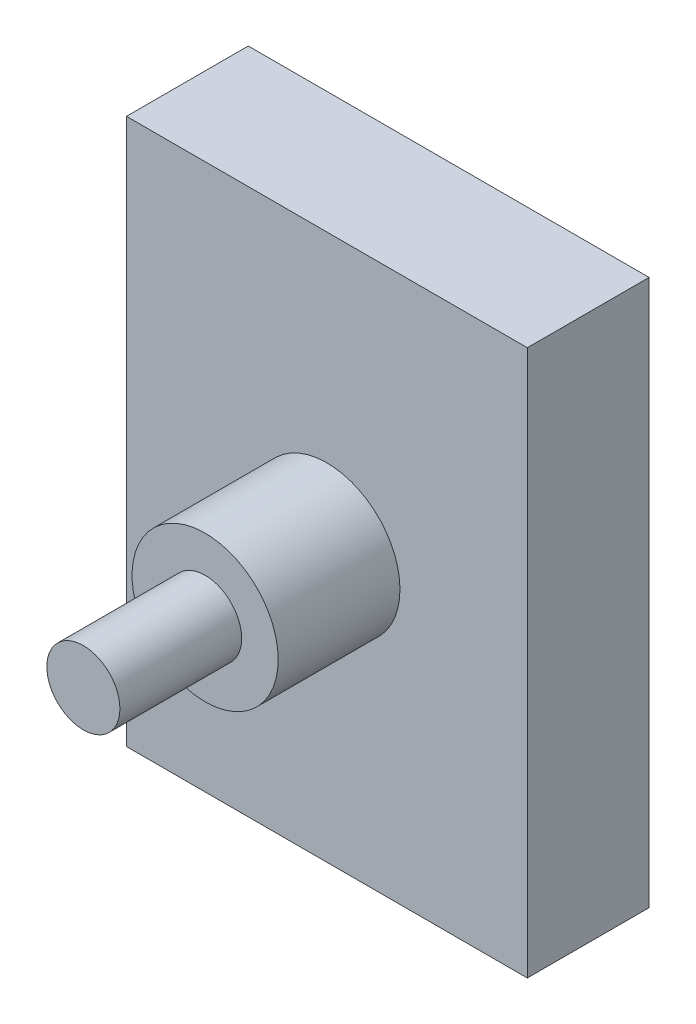
ISO-10303-21;
HEADER;
FILE_DESCRIPTION(('STEP AP214'),'2;1');
FILE_NAME('part.step','',(''),(''),'','','');
FILE_SCHEMA(('AUTOMOTIVE_DESIGN { 1 0 10303 214 1 1 1 1 }'));
ENDSEC;
DATA;
#1=APPLICATION_CONTEXT('core data for automotive mechanical design processes');
#2=APPLICATION_PROTOCOL_DEFINITION('international standard','automotive_design',2000,#1);
#3=PRODUCT_CONTEXT('',#1,'mechanical');
#4=PRODUCT('Part','Part','',(#3));
#5=PRODUCT_RELATED_PRODUCT_CATEGORY('part','',(#4));
#6=PRODUCT_DEFINITION_FORMATION('','',#4);
#7=PRODUCT_DEFINITION_CONTEXT('part definition',#1,'design');
#8=PRODUCT_DEFINITION('design','',#6,#7);
#9=PRODUCT_DEFINITION_SHAPE('','',#8);
#10=(LENGTH_UNIT() NAMED_UNIT(*) SI_UNIT(.MILLI.,.METRE.));
#11=(NAMED_UNIT(*) PLANE_ANGLE_UNIT() SI_UNIT($,.RADIAN.));
#12=(NAMED_UNIT(*) SI_UNIT($,.STERADIAN.) SOLID_ANGLE_UNIT());
#13=UNCERTAINTY_MEASURE_WITH_UNIT(LENGTH_MEASURE(1.E-05),#10,'distance_accuracy_value','');
#14=(GEOMETRIC_REPRESENTATION_CONTEXT(3) GLOBAL_UNCERTAINTY_ASSIGNED_CONTEXT((#13)) GLOBAL_UNIT_ASSIGNED_CONTEXT((#10,
#11,#12)) REPRESENTATION_CONTEXT('',''));
#15=CARTESIAN_POINT('',(0.,0.,0.));
#16=DIRECTION('',(0.,0.,1.));
#17=DIRECTION('',(1.,0.,0.));
#18=AXIS2_PLACEMENT_3D('',#15,#16,#17);
#19=CARTESIAN_POINT('',(16.4593450350775,-22.4130676206102,10.));
#20=DIRECTION('',(-1.,0.,0.));
#21=DIRECTION('',(0.,0.,1.));
#22=AXIS2_PLACEMENT_3D('',#19,#20,#21);
#23=PLANE('',#22);
#24=DIRECTION('',(0.,1.,0.));
#25=VECTOR('',#24,1.);
#26=CARTESIAN_POINT('',(16.4593450350775,-22.4130676206102,0.));
#27=LINE('',#26,#25);
#28=CARTESIAN_POINT('',(16.4593450350775,-22.4130676206102,0.));
#29=VERTEX_POINT('',#28);
#30=CARTESIAN_POINT('',(16.4593450350775,22.4130676206102,0.));
#31=VERTEX_POINT('',#30);
#32=EDGE_CURVE('E119',#29,#31,#27,.T.);
#33=ORIENTED_EDGE('',*,*,#32,.T.);
#34=DIRECTION('',(0.,0.,-1.));
#35=VECTOR('',#34,1.);
#36=CARTESIAN_POINT('',(16.4593450350775,22.4130676206102,10.));
#37=LINE('',#36,#35);
#38=CARTESIAN_POINT('',(16.4593450350775,22.4130676206102,10.));
#39=VERTEX_POINT('',#38);
#40=EDGE_CURVE('E50',#39,#31,#37,.T.);
#41=ORIENTED_EDGE('',*,*,#40,.F.);
#42=DIRECTION('',(0.,1.,0.));
#43=VECTOR('',#42,1.);
#44=CARTESIAN_POINT('',(16.4593450350775,-22.4130676206102,10.));
#45=LINE('',#44,#43);
#46=CARTESIAN_POINT('',(16.4593450350775,-22.4130676206102,10.));
#47=VERTEX_POINT('',#46);
#48=EDGE_CURVE('E102',#47,#39,#45,.T.);
#49=ORIENTED_EDGE('',*,*,#48,.F.);
#50=DIRECTION('',(0.,0.,-1.));
#51=VECTOR('',#50,1.);
#52=CARTESIAN_POINT('',(16.4593450350775,-22.4130676206102,10.));
#53=LINE('',#52,#51);
#54=EDGE_CURVE('E115',#47,#29,#53,.T.);
#55=ORIENTED_EDGE('',*,*,#54,.T.);
#56=EDGE_LOOP('',(#33,#41,#49,#55));
#57=FACE_BOUND('',#56,.T.);
#58=ADVANCED_FACE('F47',(#57),#23,.F.);
#59=CARTESIAN_POINT('',(-16.4593450350775,22.4130676206102,10.));
#60=DIRECTION('',(0.,-1.,0.));
#61=DIRECTION('',(0.,0.,-1.));
#62=AXIS2_PLACEMENT_3D('',#59,#60,#61);
#63=PLANE('',#62);
#64=DIRECTION('',(-1.,0.,0.));
#65=VECTOR('',#64,1.);
#66=CARTESIAN_POINT('',(-16.4593450350775,22.4130676206102,0.));
#67=LINE('',#66,#65);
#68=CARTESIAN_POINT('',(-16.4593450350775,22.4130676206102,0.));
#69=VERTEX_POINT('',#68);
#70=EDGE_CURVE('E108',#31,#69,#67,.T.);
#71=ORIENTED_EDGE('',*,*,#70,.T.);
#72=DIRECTION('',(0.,0.,-1.));
#73=VECTOR('',#72,1.);
#74=CARTESIAN_POINT('',(-16.4593450350775,22.4130676206102,10.));
#75=LINE('',#74,#73);
#76=CARTESIAN_POINT('',(-16.4593450350775,22.4130676206102,10.));
#77=VERTEX_POINT('',#76);
#78=EDGE_CURVE('E106',#77,#69,#75,.T.);
#79=ORIENTED_EDGE('',*,*,#78,.F.);
#80=DIRECTION('',(-1.,0.,0.));
#81=VECTOR('',#80,1.);
#82=CARTESIAN_POINT('',(-16.4593450350775,22.4130676206102,10.));
#83=LINE('',#82,#81);
#84=EDGE_CURVE('E97',#39,#77,#83,.T.);
#85=ORIENTED_EDGE('',*,*,#84,.F.);
#86=ORIENTED_EDGE('',*,*,#40,.T.);
#87=EDGE_LOOP('',(#71,#79,#85,#86));
#88=FACE_BOUND('',#87,.T.);
#89=ADVANCED_FACE('F107',(#88),#63,.F.);
#90=CARTESIAN_POINT('',(-16.4593450350775,-22.4130676206102,10.));
#91=DIRECTION('',(1.,0.,0.));
#92=DIRECTION('',(0.,0.,-1.));
#93=AXIS2_PLACEMENT_3D('',#90,#91,#92);
#94=PLANE('',#93);
#95=DIRECTION('',(0.,-1.,0.));
#96=VECTOR('',#95,1.);
#97=CARTESIAN_POINT('',(-16.4593450350775,-22.4130676206102,0.));
#98=LINE('',#97,#96);
#99=CARTESIAN_POINT('',(-16.4593450350775,-22.4130676206102,0.));
#100=VERTEX_POINT('',#99);
#101=EDGE_CURVE('E83',#69,#100,#98,.T.);
#102=ORIENTED_EDGE('',*,*,#101,.T.);
#103=DIRECTION('',(0.,0.,-1.));
#104=VECTOR('',#103,1.);
#105=CARTESIAN_POINT('',(-16.4593450350775,-22.4130676206102,10.));
#106=LINE('',#105,#104);
#107=CARTESIAN_POINT('',(-16.4593450350775,-22.4130676206102,10.));
#108=VERTEX_POINT('',#107);
#109=EDGE_CURVE('E110',#108,#100,#106,.T.);
#110=ORIENTED_EDGE('',*,*,#109,.F.);
#111=DIRECTION('',(0.,-1.,0.));
#112=VECTOR('',#111,1.);
#113=CARTESIAN_POINT('',(-16.4593450350775,-22.4130676206102,10.));
#114=LINE('',#113,#112);
#115=EDGE_CURVE('E100',#77,#108,#114,.T.);
#116=ORIENTED_EDGE('',*,*,#115,.F.);
#117=ORIENTED_EDGE('',*,*,#78,.T.);
#118=EDGE_LOOP('',(#102,#110,#116,#117));
#119=FACE_BOUND('',#118,.T.);
#120=ADVANCED_FACE('F111',(#119),#94,.F.);
#121=CARTESIAN_POINT('',(-16.4593450350775,-22.4130676206102,10.));
#122=DIRECTION('',(0.,1.,0.));
#123=DIRECTION('',(0.,0.,1.));
#124=AXIS2_PLACEMENT_3D('',#121,#122,#123);
#125=PLANE('',#124);
#126=DIRECTION('',(1.,0.,0.));
#127=VECTOR('',#126,1.);
#128=CARTESIAN_POINT('',(-16.4593450350775,-22.4130676206102,0.));
#129=LINE('',#128,#127);
#130=EDGE_CURVE('E89',#100,#29,#129,.T.);
#131=ORIENTED_EDGE('',*,*,#130,.T.);
#132=ORIENTED_EDGE('',*,*,#54,.F.);
#133=DIRECTION('',(1.,0.,0.));
#134=VECTOR('',#133,1.);
#135=CARTESIAN_POINT('',(-16.4593450350775,-22.4130676206102,10.));
#136=LINE('',#135,#134);
#137=EDGE_CURVE('E66',#108,#47,#136,.T.);
#138=ORIENTED_EDGE('',*,*,#137,.F.);
#139=ORIENTED_EDGE('',*,*,#109,.T.);
#140=EDGE_LOOP('',(#131,#132,#138,#139));
#141=FACE_BOUND('',#140,.T.);
#142=ADVANCED_FACE('F133',(#141),#125,.F.);
#143=CARTESIAN_POINT('',(0.,0.,10.));
#144=DIRECTION('',(0.,0.,-1.));
#145=DIRECTION('',(-1.,0.,0.));
#146=AXIS2_PLACEMENT_3D('',#143,#144,#145);
#147=PLANE('',#146);
#148=CARTESIAN_POINT('',(0.,0.,10.));
#149=DIRECTION('',(0.,0.,1.));
#150=DIRECTION('',(1.,0.,0.));
#151=AXIS2_PLACEMENT_3D('',#148,#149,#150);
#152=CIRCLE('',#151,6.);
#153=CARTESIAN_POINT('',(6.,0.,10.));
#154=VERTEX_POINT('',#153);
#155=EDGE_CURVE('E57',#154,#154,#152,.T.);
#156=ORIENTED_EDGE('',*,*,#155,.F.);
#157=EDGE_LOOP('',(#156));
#158=FACE_BOUND('',#157,.T.);
#159=ORIENTED_EDGE('',*,*,#48,.T.);
#160=ORIENTED_EDGE('',*,*,#84,.T.);
#161=ORIENTED_EDGE('',*,*,#115,.T.);
#162=ORIENTED_EDGE('',*,*,#137,.T.);
#163=EDGE_LOOP('',(#159,#160,#161,#162));
#164=FACE_BOUND('',#163,.T.);
#165=ADVANCED_FACE('F98',(#158,#164),#147,.F.);
#166=CARTESIAN_POINT('',(0.,0.,0.));
#167=DIRECTION('',(0.,0.,-1.));
#168=DIRECTION('',(-1.,0.,0.));
#169=AXIS2_PLACEMENT_3D('',#166,#167,#168);
#170=PLANE('',#169);
#171=ORIENTED_EDGE('',*,*,#32,.F.);
#172=ORIENTED_EDGE('',*,*,#130,.F.);
#173=ORIENTED_EDGE('',*,*,#101,.F.);
#174=ORIENTED_EDGE('',*,*,#70,.F.);
#175=EDGE_LOOP('',(#171,#172,#173,#174));
#176=FACE_BOUND('',#175,.T.);
#177=ADVANCED_FACE('F136',(#176),#170,.T.);
#178=CARTESIAN_POINT('',(0.,0.,20.));
#179=DIRECTION('',(0.,0.,-1.));
#180=DIRECTION('',(-1.,0.,0.));
#181=AXIS2_PLACEMENT_3D('',#178,#179,#180);
#182=CYLINDRICAL_SURFACE('',#181,6.);
#183=CARTESIAN_POINT('',(0.,0.,20.));
#184=DIRECTION('',(0.,0.,1.));
#185=DIRECTION('',(1.,0.,0.));
#186=AXIS2_PLACEMENT_3D('',#183,#184,#185);
#187=CIRCLE('',#186,6.);
#188=CARTESIAN_POINT('',(6.,0.,20.));
#189=VERTEX_POINT('',#188);
#190=EDGE_CURVE('E123',#189,#189,#187,.T.);
#191=ORIENTED_EDGE('',*,*,#190,.F.);
#192=EDGE_LOOP('',(#191));
#193=FACE_BOUND('',#192,.T.);
#194=ORIENTED_EDGE('',*,*,#155,.T.);
#195=EDGE_LOOP('',(#194));
#196=FACE_BOUND('',#195,.T.);
#197=ADVANCED_FACE('F162',(#193,#196),#182,.T.);
#198=CARTESIAN_POINT('',(0.,0.,20.));
#199=DIRECTION('',(0.,0.,1.));
#200=DIRECTION('',(1.,0.,0.));
#201=AXIS2_PLACEMENT_3D('',#198,#199,#200);
#202=PLANE('',#201);
#203=CARTESIAN_POINT('',(0.,0.,20.));
#204=DIRECTION('',(0.,0.,1.));
#205=DIRECTION('',(1.,0.,0.));
#206=AXIS2_PLACEMENT_3D('',#203,#204,#205);
#207=CIRCLE('',#206,3.);
#208=CARTESIAN_POINT('',(3.,0.,20.));
#209=VERTEX_POINT('',#208);
#210=EDGE_CURVE('E11',#209,#209,#207,.T.);
#211=ORIENTED_EDGE('',*,*,#210,.F.);
#212=EDGE_LOOP('',(#211));
#213=FACE_BOUND('',#212,.T.);
#214=ORIENTED_EDGE('',*,*,#190,.T.);
#215=EDGE_LOOP('',(#214));
#216=FACE_BOUND('',#215,.T.);
#217=ADVANCED_FACE('F156',(#213,#216),#202,.T.);
#218=CARTESIAN_POINT('',(0.,0.,30.));
#219=DIRECTION('',(0.,0.,-1.));
#220=DIRECTION('',(-1.,0.,0.));
#221=AXIS2_PLACEMENT_3D('',#218,#219,#220);
#222=CYLINDRICAL_SURFACE('',#221,3.);
#223=CARTESIAN_POINT('',(0.,0.,30.));
#224=DIRECTION('',(0.,0.,1.));
#225=DIRECTION('',(1.,0.,0.));
#226=AXIS2_PLACEMENT_3D('',#223,#224,#225);
#227=CIRCLE('',#226,3.);
#228=CARTESIAN_POINT('',(3.,0.,30.));
#229=VERTEX_POINT('',#228);
#230=EDGE_CURVE('E145',#229,#229,#227,.T.);
#231=ORIENTED_EDGE('',*,*,#230,.F.);
#232=EDGE_LOOP('',(#231));
#233=FACE_BOUND('',#232,.T.);
#234=ORIENTED_EDGE('',*,*,#210,.T.);
#235=EDGE_LOOP('',(#234));
#236=FACE_BOUND('',#235,.T.);
#237=ADVANCED_FACE('F153',(#233,#236),#222,.T.);
#238=CARTESIAN_POINT('',(0.,0.,30.));
#239=DIRECTION('',(0.,0.,1.));
#240=DIRECTION('',(1.,0.,0.));
#241=AXIS2_PLACEMENT_3D('',#238,#239,#240);
#242=PLANE('',#241);
#243=ORIENTED_EDGE('',*,*,#230,.T.);
#244=EDGE_LOOP('',(#243));
#245=FACE_BOUND('',#244,.T.);
#246=ADVANCED_FACE('F151',(#245),#242,.T.);
#247=CLOSED_SHELL('',(#58,#89,#120,#142,#165,#177,#197,#217,#237,#246));
#248=MANIFOLD_SOLID_BREP('B2',#247);
#249=ADVANCED_BREP_SHAPE_REPRESENTATION('',(#18,#248),#14);
#250=SHAPE_DEFINITION_REPRESENTATION(#9,#249);
ENDSEC;
END-ISO-10303-21;
